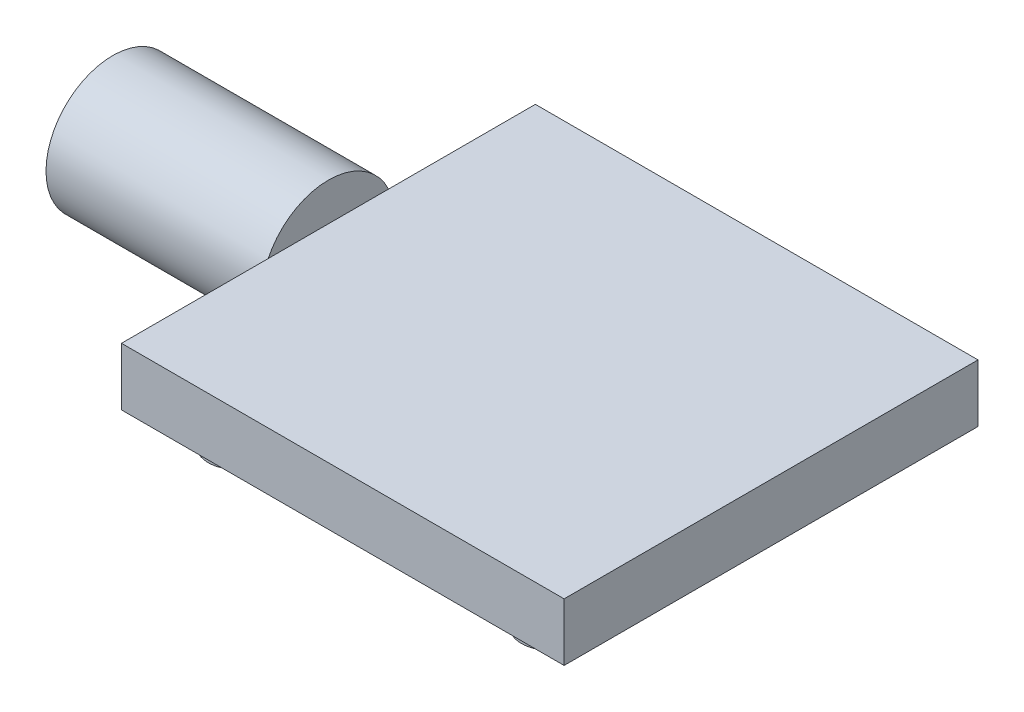
ISO-10303-21;
HEADER;
FILE_DESCRIPTION(('STEP AP214'),'2;1');
FILE_NAME('part.step','',(''),(''),'','','');
FILE_SCHEMA(('AUTOMOTIVE_DESIGN { 1 0 10303 214 1 1 1 1 }'));
ENDSEC;
DATA;
#1=APPLICATION_CONTEXT('core data for automotive mechanical design processes');
#2=APPLICATION_PROTOCOL_DEFINITION('international standard','automotive_design',2000,#1);
#3=PRODUCT_CONTEXT('',#1,'mechanical');
#4=PRODUCT('Part','Part','',(#3));
#5=PRODUCT_RELATED_PRODUCT_CATEGORY('part','',(#4));
#6=PRODUCT_DEFINITION_FORMATION('','',#4);
#7=PRODUCT_DEFINITION_CONTEXT('part definition',#1,'design');
#8=PRODUCT_DEFINITION('design','',#6,#7);
#9=PRODUCT_DEFINITION_SHAPE('','',#8);
#10=(LENGTH_UNIT() NAMED_UNIT(*) SI_UNIT(.MILLI.,.METRE.));
#11=(NAMED_UNIT(*) PLANE_ANGLE_UNIT() SI_UNIT($,.RADIAN.));
#12=(NAMED_UNIT(*) SI_UNIT($,.STERADIAN.) SOLID_ANGLE_UNIT());
#13=UNCERTAINTY_MEASURE_WITH_UNIT(LENGTH_MEASURE(1.E-05),#10,'distance_accuracy_value','');
#14=(GEOMETRIC_REPRESENTATION_CONTEXT(3) GLOBAL_UNCERTAINTY_ASSIGNED_CONTEXT((#13)) GLOBAL_UNIT_ASSIGNED_CONTEXT((#10,
#11,#12)) REPRESENTATION_CONTEXT('',''));
#15=CARTESIAN_POINT('',(0.,0.,0.));
#16=DIRECTION('',(0.,0.,1.));
#17=DIRECTION('',(1.,0.,0.));
#18=AXIS2_PLACEMENT_3D('',#15,#16,#17);
#19=CARTESIAN_POINT('',(-21.55,5.62,20.15));
#20=DIRECTION('',(1.,0.,0.));
#21=DIRECTION('',(0.,0.,-1.));
#22=AXIS2_PLACEMENT_3D('',#19,#20,#21);
#23=PLANE('',#22);
#24=CARTESIAN_POINT('',(-21.55,2.81,0.));
#25=DIRECTION('',(-1.,0.,0.));
#26=DIRECTION('',(0.,0.,1.));
#27=AXIS2_PLACEMENT_3D('',#24,#25,#26);
#28=CIRCLE('',#27,6.5);
#29=CARTESIAN_POINT('',(-21.55,5.62,-5.8612200095202));
#30=VERTEX_POINT('',#29);
#31=CARTESIAN_POINT('',(-21.55,0.,-5.8612200095202));
#32=VERTEX_POINT('',#31);
#33=EDGE_CURVE('E11',#30,#32,#28,.T.);
#34=ORIENTED_EDGE('',*,*,#33,.F.);
#35=DIRECTION('',(0.,0.,1.));
#36=VECTOR('',#35,1.);
#37=CARTESIAN_POINT('',(-21.55,5.62,20.15));
#38=LINE('',#37,#36);
#39=CARTESIAN_POINT('',(-21.55,5.62,-20.15));
#40=VERTEX_POINT('',#39);
#41=EDGE_CURVE('E103',#40,#30,#38,.T.);
#42=ORIENTED_EDGE('',*,*,#41,.F.);
#43=DIRECTION('',(0.,-1.,0.));
#44=VECTOR('',#43,1.);
#45=CARTESIAN_POINT('',(-21.55,5.62,-20.15));
#46=LINE('',#45,#44);
#47=CARTESIAN_POINT('',(-21.55,0.,-20.15));
#48=VERTEX_POINT('',#47);
#49=EDGE_CURVE('E171',#40,#48,#46,.T.);
#50=ORIENTED_EDGE('',*,*,#49,.T.);
#51=DIRECTION('',(0.,0.,1.));
#52=VECTOR('',#51,1.);
#53=CARTESIAN_POINT('',(-21.55,0.,20.15));
#54=LINE('',#53,#52);
#55=EDGE_CURVE('E164',#48,#32,#54,.T.);
#56=ORIENTED_EDGE('',*,*,#55,.T.);
#57=EDGE_LOOP('',(#34,#42,#50,#56));
#58=FACE_BOUND('',#57,.T.);
#59=ADVANCED_FACE('F43',(#58),#23,.F.);
#60=CARTESIAN_POINT('',(21.55,5.62,20.15));
#61=DIRECTION('',(-1.,0.,0.));
#62=DIRECTION('',(0.,0.,1.));
#63=AXIS2_PLACEMENT_3D('',#60,#61,#62);
#64=PLANE('',#63);
#65=DIRECTION('',(0.,0.,-1.));
#66=VECTOR('',#65,1.);
#67=CARTESIAN_POINT('',(21.55,0.,20.15));
#68=LINE('',#67,#66);
#69=CARTESIAN_POINT('',(21.55,0.,20.15));
#70=VERTEX_POINT('',#69);
#71=CARTESIAN_POINT('',(21.55,0.,-20.15));
#72=VERTEX_POINT('',#71);
#73=EDGE_CURVE('E158',#70,#72,#68,.T.);
#74=ORIENTED_EDGE('',*,*,#73,.T.);
#75=DIRECTION('',(0.,-1.,0.));
#76=VECTOR('',#75,1.);
#77=CARTESIAN_POINT('',(21.55,5.62,-20.15));
#78=LINE('',#77,#76);
#79=CARTESIAN_POINT('',(21.55,5.62,-20.15));
#80=VERTEX_POINT('',#79);
#81=EDGE_CURVE('E174',#80,#72,#78,.T.);
#82=ORIENTED_EDGE('',*,*,#81,.F.);
#83=DIRECTION('',(0.,0.,-1.));
#84=VECTOR('',#83,1.);
#85=CARTESIAN_POINT('',(21.55,5.62,20.15));
#86=LINE('',#85,#84);
#87=CARTESIAN_POINT('',(21.55,5.62,20.15));
#88=VERTEX_POINT('',#87);
#89=EDGE_CURVE('E151',#88,#80,#86,.T.);
#90=ORIENTED_EDGE('',*,*,#89,.F.);
#91=DIRECTION('',(0.,-1.,0.));
#92=VECTOR('',#91,1.);
#93=CARTESIAN_POINT('',(21.55,5.62,20.15));
#94=LINE('',#93,#92);
#95=EDGE_CURVE('E157',#88,#70,#94,.T.);
#96=ORIENTED_EDGE('',*,*,#95,.T.);
#97=EDGE_LOOP('',(#74,#82,#90,#96));
#98=FACE_BOUND('',#97,.T.);
#99=ADVANCED_FACE('F45',(#98),#64,.F.);
#100=CARTESIAN_POINT('',(-21.55,5.62,-20.15));
#101=DIRECTION('',(0.,0.,1.));
#102=DIRECTION('',(1.,0.,0.));
#103=AXIS2_PLACEMENT_3D('',#100,#101,#102);
#104=PLANE('',#103);
#105=DIRECTION('',(-1.,0.,0.));
#106=VECTOR('',#105,1.);
#107=CARTESIAN_POINT('',(-21.55,0.,-20.15));
#108=LINE('',#107,#106);
#109=EDGE_CURVE('E161',#72,#48,#108,.T.);
#110=ORIENTED_EDGE('',*,*,#109,.T.);
#111=ORIENTED_EDGE('',*,*,#49,.F.);
#112=DIRECTION('',(-1.,0.,0.));
#113=VECTOR('',#112,1.);
#114=CARTESIAN_POINT('',(-21.55,5.62,-20.15));
#115=LINE('',#114,#113);
#116=EDGE_CURVE('E112',#80,#40,#115,.T.);
#117=ORIENTED_EDGE('',*,*,#116,.F.);
#118=ORIENTED_EDGE('',*,*,#81,.T.);
#119=EDGE_LOOP('',(#110,#111,#117,#118));
#120=FACE_BOUND('',#119,.T.);
#121=ADVANCED_FACE('F229',(#120),#104,.F.);
#122=CARTESIAN_POINT('',(-21.55,0.,5.8612200095202));
#123=VERTEX_POINT('',#122);
#124=CARTESIAN_POINT('',(-21.55,5.62,5.8612200095202));
#125=VERTEX_POINT('',#124);
#126=EDGE_CURVE('E52',#123,#125,#28,.T.);
#127=ORIENTED_EDGE('',*,*,#126,.F.);
#128=CARTESIAN_POINT('',(-21.55,0.,20.15));
#129=VERTEX_POINT('',#128);
#130=EDGE_CURVE('E163',#123,#129,#54,.T.);
#131=ORIENTED_EDGE('',*,*,#130,.T.);
#132=DIRECTION('',(0.,-1.,0.));
#133=VECTOR('',#132,1.);
#134=CARTESIAN_POINT('',(-21.55,5.62,20.15));
#135=LINE('',#134,#133);
#136=CARTESIAN_POINT('',(-21.55,5.62,20.15));
#137=VERTEX_POINT('',#136);
#138=EDGE_CURVE('E110',#137,#129,#135,.T.);
#139=ORIENTED_EDGE('',*,*,#138,.F.);
#140=EDGE_CURVE('E101',#125,#137,#38,.T.);
#141=ORIENTED_EDGE('',*,*,#140,.F.);
#142=EDGE_LOOP('',(#127,#131,#139,#141));
#143=FACE_BOUND('',#142,.T.);
#144=ADVANCED_FACE('F108',(#143),#23,.F.);
#145=CARTESIAN_POINT('',(-21.55,5.62,20.15));
#146=DIRECTION('',(0.,0.,-1.));
#147=DIRECTION('',(-1.,0.,0.));
#148=AXIS2_PLACEMENT_3D('',#145,#146,#147);
#149=PLANE('',#148);
#150=DIRECTION('',(1.,0.,0.));
#151=VECTOR('',#150,1.);
#152=CARTESIAN_POINT('',(-21.55,0.,20.15));
#153=LINE('',#152,#151);
#154=EDGE_CURVE('E153',#129,#70,#153,.T.);
#155=ORIENTED_EDGE('',*,*,#154,.T.);
#156=ORIENTED_EDGE('',*,*,#95,.F.);
#157=DIRECTION('',(1.,0.,0.));
#158=VECTOR('',#157,1.);
#159=CARTESIAN_POINT('',(-21.55,5.62,20.15));
#160=LINE('',#159,#158);
#161=EDGE_CURVE('E155',#137,#88,#160,.T.);
#162=ORIENTED_EDGE('',*,*,#161,.F.);
#163=ORIENTED_EDGE('',*,*,#138,.T.);
#164=EDGE_LOOP('',(#155,#156,#162,#163));
#165=FACE_BOUND('',#164,.T.);
#166=ADVANCED_FACE('F232',(#165),#149,.F.);
#167=CARTESIAN_POINT('',(0.,5.62,0.));
#168=DIRECTION('',(0.,-1.,0.));
#169=DIRECTION('',(0.,0.,-1.));
#170=AXIS2_PLACEMENT_3D('',#167,#168,#169);
#171=PLANE('',#170);
#172=ORIENTED_EDGE('',*,*,#89,.T.);
#173=ORIENTED_EDGE('',*,*,#116,.T.);
#174=ORIENTED_EDGE('',*,*,#41,.T.);
#175=EDGE_CURVE('E98',#30,#125,#38,.T.);
#176=ORIENTED_EDGE('',*,*,#175,.T.);
#177=ORIENTED_EDGE('',*,*,#140,.T.);
#178=ORIENTED_EDGE('',*,*,#161,.T.);
#179=EDGE_LOOP('',(#172,#173,#174,#176,#177,#178));
#180=FACE_BOUND('',#179,.T.);
#181=ADVANCED_FACE('F100',(#180),#171,.F.);
#182=CARTESIAN_POINT('',(0.,0.,0.));
#183=DIRECTION('',(0.,-1.,0.));
#184=DIRECTION('',(0.,0.,-1.));
#185=AXIS2_PLACEMENT_3D('',#182,#183,#184);
#186=PLANE('',#185);
#187=CARTESIAN_POINT('',(-15.25,0.,15.25));
#188=DIRECTION('',(0.,-1.,0.));
#189=DIRECTION('',(0.,0.,-1.));
#190=AXIS2_PLACEMENT_3D('',#187,#188,#189);
#191=CIRCLE('',#190,2.75);
#192=CARTESIAN_POINT('',(-15.25,0.,12.5));
#193=VERTEX_POINT('',#192);
#194=EDGE_CURVE('E47',#193,#193,#191,.T.);
#195=ORIENTED_EDGE('',*,*,#194,.F.);
#196=EDGE_LOOP('',(#195));
#197=FACE_BOUND('',#196,.T.);
#198=CARTESIAN_POINT('',(15.25,0.,15.25));
#199=DIRECTION('',(0.,-1.,0.));
#200=DIRECTION('',(0.,0.,-1.));
#201=AXIS2_PLACEMENT_3D('',#198,#199,#200);
#202=CIRCLE('',#201,2.75);
#203=CARTESIAN_POINT('',(15.25,0.,12.5));
#204=VERTEX_POINT('',#203);
#205=EDGE_CURVE('E187',#204,#204,#202,.T.);
#206=ORIENTED_EDGE('',*,*,#205,.F.);
#207=EDGE_LOOP('',(#206));
#208=FACE_BOUND('',#207,.T.);
#209=CARTESIAN_POINT('',(15.25,0.,-15.25));
#210=DIRECTION('',(0.,-1.,0.));
#211=DIRECTION('',(0.,0.,-1.));
#212=AXIS2_PLACEMENT_3D('',#209,#210,#211);
#213=CIRCLE('',#212,2.75);
#214=CARTESIAN_POINT('',(15.25,0.,-18.));
#215=VERTEX_POINT('',#214);
#216=EDGE_CURVE('E182',#215,#215,#213,.T.);
#217=ORIENTED_EDGE('',*,*,#216,.F.);
#218=EDGE_LOOP('',(#217));
#219=FACE_BOUND('',#218,.T.);
#220=CARTESIAN_POINT('',(-15.25,0.,-15.25));
#221=DIRECTION('',(0.,-1.,0.));
#222=DIRECTION('',(0.,0.,-1.));
#223=AXIS2_PLACEMENT_3D('',#220,#221,#222);
#224=CIRCLE('',#223,2.75);
#225=CARTESIAN_POINT('',(-15.25,0.,-18.));
#226=VERTEX_POINT('',#225);
#227=EDGE_CURVE('E177',#226,#226,#224,.T.);
#228=ORIENTED_EDGE('',*,*,#227,.F.);
#229=EDGE_LOOP('',(#228));
#230=FACE_BOUND('',#229,.T.);
#231=ORIENTED_EDGE('',*,*,#73,.F.);
#232=ORIENTED_EDGE('',*,*,#154,.F.);
#233=ORIENTED_EDGE('',*,*,#130,.F.);
#234=EDGE_CURVE('E166',#32,#123,#54,.T.);
#235=ORIENTED_EDGE('',*,*,#234,.F.);
#236=ORIENTED_EDGE('',*,*,#55,.F.);
#237=ORIENTED_EDGE('',*,*,#109,.F.);
#238=EDGE_LOOP('',(#231,#232,#233,#235,#236,#237));
#239=FACE_BOUND('',#238,.T.);
#240=ADVANCED_FACE('F247',(#197,#208,#219,#230,#239),#186,.T.);
#241=CARTESIAN_POINT('',(-15.25,-2.38,-15.25));
#242=DIRECTION('',(0.,1.,0.));
#243=DIRECTION('',(0.,0.,1.));
#244=AXIS2_PLACEMENT_3D('',#241,#242,#243);
#245=CYLINDRICAL_SURFACE('',#244,2.75);
#246=ORIENTED_EDGE('',*,*,#227,.T.);
#247=EDGE_LOOP('',(#246));
#248=FACE_BOUND('',#247,.T.);
#249=CARTESIAN_POINT('',(-15.25,-2.38,-15.25));
#250=DIRECTION('',(0.,1.,0.));
#251=DIRECTION('',(0.,0.,1.));
#252=AXIS2_PLACEMENT_3D('',#249,#250,#251);
#253=CIRCLE('',#252,2.75);
#254=CARTESIAN_POINT('',(-15.25,-2.38,-12.5));
#255=VERTEX_POINT('',#254);
#256=EDGE_CURVE('E147',#255,#255,#253,.T.);
#257=ORIENTED_EDGE('',*,*,#256,.T.);
#258=EDGE_LOOP('',(#257));
#259=FACE_BOUND('',#258,.T.);
#260=ADVANCED_FACE('F383',(#248,#259),#245,.T.);
#261=CARTESIAN_POINT('',(-15.25,-2.38,-15.25));
#262=DIRECTION('',(0.,1.,0.));
#263=DIRECTION('',(0.,0.,1.));
#264=AXIS2_PLACEMENT_3D('',#261,#262,#263);
#265=PLANE('',#264);
#266=CARTESIAN_POINT('',(-15.25,-2.38,-15.25));
#267=DIRECTION('',(0.,1.,0.));
#268=DIRECTION('',(0.,0.,1.));
#269=AXIS2_PLACEMENT_3D('',#266,#267,#268);
#270=CIRCLE('',#269,1.75);
#271=CARTESIAN_POINT('',(-15.25,-2.38,-13.5));
#272=VERTEX_POINT('',#271);
#273=EDGE_CURVE('E144',#272,#272,#270,.T.);
#274=ORIENTED_EDGE('',*,*,#273,.T.);
#275=EDGE_LOOP('',(#274));
#276=FACE_BOUND('',#275,.T.);
#277=ORIENTED_EDGE('',*,*,#256,.F.);
#278=EDGE_LOOP('',(#277));
#279=FACE_BOUND('',#278,.T.);
#280=ADVANCED_FACE('F373',(#276,#279),#265,.F.);
#281=CARTESIAN_POINT('',(-15.25,-2.38,-15.25));
#282=DIRECTION('',(0.,1.,0.));
#283=DIRECTION('',(0.,0.,1.));
#284=AXIS2_PLACEMENT_3D('',#281,#282,#283);
#285=CYLINDRICAL_SURFACE('',#284,1.75);
#286=CARTESIAN_POINT('',(-15.25,0.,-15.25));
#287=DIRECTION('',(0.,-1.,0.));
#288=DIRECTION('',(0.,0.,-1.));
#289=AXIS2_PLACEMENT_3D('',#286,#287,#288);
#290=CIRCLE('',#289,1.75);
#291=CARTESIAN_POINT('',(-15.25,0.,-17.));
#292=VERTEX_POINT('',#291);
#293=EDGE_CURVE('E150',#292,#292,#290,.T.);
#294=ORIENTED_EDGE('',*,*,#293,.F.);
#295=EDGE_LOOP('',(#294));
#296=FACE_BOUND('',#295,.T.);
#297=ORIENTED_EDGE('',*,*,#273,.F.);
#298=EDGE_LOOP('',(#297));
#299=FACE_BOUND('',#298,.T.);
#300=ADVANCED_FACE('F368',(#296,#299),#285,.F.);
#301=ORIENTED_EDGE('',*,*,#293,.T.);
#302=EDGE_LOOP('',(#301));
#303=FACE_BOUND('',#302,.T.);
#304=ADVANCED_FACE('F361',(#303),#186,.T.);
#305=CARTESIAN_POINT('',(15.25,-2.38,-15.25));
#306=DIRECTION('',(0.,1.,0.));
#307=DIRECTION('',(0.,0.,1.));
#308=AXIS2_PLACEMENT_3D('',#305,#306,#307);
#309=CYLINDRICAL_SURFACE('',#308,2.75);
#310=ORIENTED_EDGE('',*,*,#216,.T.);
#311=EDGE_LOOP('',(#310));
#312=FACE_BOUND('',#311,.T.);
#313=CARTESIAN_POINT('',(15.25,-2.38,-15.25));
#314=DIRECTION('',(0.,1.,0.));
#315=DIRECTION('',(0.,0.,-1.));
#316=AXIS2_PLACEMENT_3D('',#313,#314,#315);
#317=CIRCLE('',#316,2.75);
#318=CARTESIAN_POINT('',(15.25,-2.38,-18.));
#319=VERTEX_POINT('',#318);
#320=EDGE_CURVE('E137',#319,#319,#317,.T.);
#321=ORIENTED_EDGE('',*,*,#320,.T.);
#322=EDGE_LOOP('',(#321));
#323=FACE_BOUND('',#322,.T.);
#324=ADVANCED_FACE('F351',(#312,#323),#309,.T.);
#325=CARTESIAN_POINT('',(15.25,-2.38,-15.25));
#326=DIRECTION('',(0.,-1.,0.));
#327=DIRECTION('',(0.,0.,-1.));
#328=AXIS2_PLACEMENT_3D('',#325,#326,#327);
#329=PLANE('',#328);
#330=CARTESIAN_POINT('',(15.25,-2.38,-15.25));
#331=DIRECTION('',(0.,1.,0.));
#332=DIRECTION('',(0.,0.,-1.));
#333=AXIS2_PLACEMENT_3D('',#330,#331,#332);
#334=CIRCLE('',#333,1.75);
#335=CARTESIAN_POINT('',(15.25,-2.38,-17.));
#336=VERTEX_POINT('',#335);
#337=EDGE_CURVE('E140',#336,#336,#334,.T.);
#338=ORIENTED_EDGE('',*,*,#337,.T.);
#339=EDGE_LOOP('',(#338));
#340=FACE_BOUND('',#339,.T.);
#341=ORIENTED_EDGE('',*,*,#320,.F.);
#342=EDGE_LOOP('',(#341));
#343=FACE_BOUND('',#342,.T.);
#344=ADVANCED_FACE('F341',(#340,#343),#329,.T.);
#345=CARTESIAN_POINT('',(15.25,-2.38,-15.25));
#346=DIRECTION('',(0.,1.,0.));
#347=DIRECTION('',(0.,0.,1.));
#348=AXIS2_PLACEMENT_3D('',#345,#346,#347);
#349=CYLINDRICAL_SURFACE('',#348,1.75);
#350=CARTESIAN_POINT('',(15.25,0.,-15.25));
#351=DIRECTION('',(0.,-1.,0.));
#352=DIRECTION('',(0.,0.,-1.));
#353=AXIS2_PLACEMENT_3D('',#350,#351,#352);
#354=CIRCLE('',#353,1.75);
#355=CARTESIAN_POINT('',(15.25,0.,-17.));
#356=VERTEX_POINT('',#355);
#357=EDGE_CURVE('E143',#356,#356,#354,.T.);
#358=ORIENTED_EDGE('',*,*,#357,.F.);
#359=EDGE_LOOP('',(#358));
#360=FACE_BOUND('',#359,.T.);
#361=ORIENTED_EDGE('',*,*,#337,.F.);
#362=EDGE_LOOP('',(#361));
#363=FACE_BOUND('',#362,.T.);
#364=ADVANCED_FACE('F336',(#360,#363),#349,.F.);
#365=ORIENTED_EDGE('',*,*,#357,.T.);
#366=EDGE_LOOP('',(#365));
#367=FACE_BOUND('',#366,.T.);
#368=ADVANCED_FACE('F219',(#367),#186,.T.);
#369=CARTESIAN_POINT('',(15.25,-2.38,15.25));
#370=DIRECTION('',(0.,1.,0.));
#371=DIRECTION('',(0.,0.,1.));
#372=AXIS2_PLACEMENT_3D('',#369,#370,#371);
#373=CYLINDRICAL_SURFACE('',#372,2.75);
#374=ORIENTED_EDGE('',*,*,#205,.T.);
#375=EDGE_LOOP('',(#374));
#376=FACE_BOUND('',#375,.T.);
#377=CARTESIAN_POINT('',(15.25,-2.38,15.25));
#378=DIRECTION('',(0.,1.,0.));
#379=DIRECTION('',(0.,0.,1.));
#380=AXIS2_PLACEMENT_3D('',#377,#378,#379);
#381=CIRCLE('',#380,2.75);
#382=CARTESIAN_POINT('',(15.25,-2.38,18.));
#383=VERTEX_POINT('',#382);
#384=EDGE_CURVE('E130',#383,#383,#381,.T.);
#385=ORIENTED_EDGE('',*,*,#384,.T.);
#386=EDGE_LOOP('',(#385));
#387=FACE_BOUND('',#386,.T.);
#388=ADVANCED_FACE('F320',(#376,#387),#373,.T.);
#389=CARTESIAN_POINT('',(15.25,-2.38,15.25));
#390=DIRECTION('',(0.,1.,0.));
#391=DIRECTION('',(0.,0.,1.));
#392=AXIS2_PLACEMENT_3D('',#389,#390,#391);
#393=PLANE('',#392);
#394=CARTESIAN_POINT('',(15.25,-2.38,15.25));
#395=DIRECTION('',(0.,1.,0.));
#396=DIRECTION('',(0.,0.,1.));
#397=AXIS2_PLACEMENT_3D('',#394,#395,#396);
#398=CIRCLE('',#397,1.75);
#399=CARTESIAN_POINT('',(15.25,-2.38,17.));
#400=VERTEX_POINT('',#399);
#401=EDGE_CURVE('E133',#400,#400,#398,.T.);
#402=ORIENTED_EDGE('',*,*,#401,.T.);
#403=EDGE_LOOP('',(#402));
#404=FACE_BOUND('',#403,.T.);
#405=ORIENTED_EDGE('',*,*,#384,.F.);
#406=EDGE_LOOP('',(#405));
#407=FACE_BOUND('',#406,.T.);
#408=ADVANCED_FACE('F310',(#404,#407),#393,.F.);
#409=CARTESIAN_POINT('',(15.25,-2.38,15.25));
#410=DIRECTION('',(0.,1.,0.));
#411=DIRECTION('',(0.,0.,1.));
#412=AXIS2_PLACEMENT_3D('',#409,#410,#411);
#413=CYLINDRICAL_SURFACE('',#412,1.75);
#414=CARTESIAN_POINT('',(15.25,0.,15.25));
#415=DIRECTION('',(0.,-1.,0.));
#416=DIRECTION('',(0.,0.,-1.));
#417=AXIS2_PLACEMENT_3D('',#414,#415,#416);
#418=CIRCLE('',#417,1.75);
#419=CARTESIAN_POINT('',(15.25,0.,13.5));
#420=VERTEX_POINT('',#419);
#421=EDGE_CURVE('E136',#420,#420,#418,.T.);
#422=ORIENTED_EDGE('',*,*,#421,.F.);
#423=EDGE_LOOP('',(#422));
#424=FACE_BOUND('',#423,.T.);
#425=ORIENTED_EDGE('',*,*,#401,.F.);
#426=EDGE_LOOP('',(#425));
#427=FACE_BOUND('',#426,.T.);
#428=ADVANCED_FACE('F216',(#424,#427),#413,.F.);
#429=ORIENTED_EDGE('',*,*,#421,.T.);
#430=EDGE_LOOP('',(#429));
#431=FACE_BOUND('',#430,.T.);
#432=ADVANCED_FACE('F210',(#431),#186,.T.);
#433=CARTESIAN_POINT('',(-15.25,-2.38,15.25));
#434=DIRECTION('',(0.,1.,0.));
#435=DIRECTION('',(0.,0.,1.));
#436=AXIS2_PLACEMENT_3D('',#433,#434,#435);
#437=CYLINDRICAL_SURFACE('',#436,2.75);
#438=ORIENTED_EDGE('',*,*,#194,.T.);
#439=EDGE_LOOP('',(#438));
#440=FACE_BOUND('',#439,.T.);
#441=CARTESIAN_POINT('',(-15.25,-2.38,15.25));
#442=DIRECTION('',(0.,1.,0.));
#443=DIRECTION('',(0.,0.,-1.));
#444=AXIS2_PLACEMENT_3D('',#441,#442,#443);
#445=CIRCLE('',#444,2.75);
#446=CARTESIAN_POINT('',(-15.25,-2.38,12.5));
#447=VERTEX_POINT('',#446);
#448=EDGE_CURVE('E121',#447,#447,#445,.T.);
#449=ORIENTED_EDGE('',*,*,#448,.T.);
#450=EDGE_LOOP('',(#449));
#451=FACE_BOUND('',#450,.T.);
#452=ADVANCED_FACE('F205',(#440,#451),#437,.T.);
#453=CARTESIAN_POINT('',(-15.25,-2.38,15.25));
#454=DIRECTION('',(0.,-1.,0.));
#455=DIRECTION('',(0.,0.,-1.));
#456=AXIS2_PLACEMENT_3D('',#453,#454,#455);
#457=PLANE('',#456);
#458=CARTESIAN_POINT('',(-15.25,-2.38,15.25));
#459=DIRECTION('',(0.,1.,0.));
#460=DIRECTION('',(0.,0.,-1.));
#461=AXIS2_PLACEMENT_3D('',#458,#459,#460);
#462=CIRCLE('',#461,1.75);
#463=CARTESIAN_POINT('',(-15.25,-2.38,13.5));
#464=VERTEX_POINT('',#463);
#465=EDGE_CURVE('E126',#464,#464,#462,.T.);
#466=ORIENTED_EDGE('',*,*,#465,.T.);
#467=EDGE_LOOP('',(#466));
#468=FACE_BOUND('',#467,.T.);
#469=ORIENTED_EDGE('',*,*,#448,.F.);
#470=EDGE_LOOP('',(#469));
#471=FACE_BOUND('',#470,.T.);
#472=ADVANCED_FACE('F199',(#468,#471),#457,.T.);
#473=CARTESIAN_POINT('',(-15.25,-2.38,15.25));
#474=DIRECTION('',(0.,1.,0.));
#475=DIRECTION('',(0.,0.,1.));
#476=AXIS2_PLACEMENT_3D('',#473,#474,#475);
#477=CYLINDRICAL_SURFACE('',#476,1.75);
#478=CARTESIAN_POINT('',(-15.25,0.,15.25));
#479=DIRECTION('',(0.,-1.,0.));
#480=DIRECTION('',(0.,0.,-1.));
#481=AXIS2_PLACEMENT_3D('',#478,#479,#480);
#482=CIRCLE('',#481,1.75);
#483=CARTESIAN_POINT('',(-15.25,0.,13.5));
#484=VERTEX_POINT('',#483);
#485=EDGE_CURVE('E129',#484,#484,#482,.T.);
#486=ORIENTED_EDGE('',*,*,#485,.F.);
#487=EDGE_LOOP('',(#486));
#488=FACE_BOUND('',#487,.T.);
#489=ORIENTED_EDGE('',*,*,#465,.F.);
#490=EDGE_LOOP('',(#489));
#491=FACE_BOUND('',#490,.T.);
#492=ADVANCED_FACE('F196',(#488,#491),#477,.F.);
#493=ORIENTED_EDGE('',*,*,#485,.T.);
#494=EDGE_LOOP('',(#493));
#495=FACE_BOUND('',#494,.T.);
#496=ADVANCED_FACE('F194',(#495),#186,.T.);
#497=CARTESIAN_POINT('',(-21.55,2.81,0.));
#498=DIRECTION('',(-1.,0.,0.));
#499=DIRECTION('',(0.,0.,1.));
#500=AXIS2_PLACEMENT_3D('',#497,#498,#499);
#501=PLANE('',#500);
#502=EDGE_CURVE('E54',#32,#123,#28,.T.);
#503=ORIENTED_EDGE('',*,*,#502,.F.);
#504=ORIENTED_EDGE('',*,*,#234,.T.);
#505=EDGE_LOOP('',(#503,#504));
#506=FACE_BOUND('',#505,.T.);
#507=ADVANCED_FACE('F253',(#506),#501,.F.);
#508=CARTESIAN_POINT('',(-42.55,2.81,0.));
#509=DIRECTION('',(1.,0.,0.));
#510=DIRECTION('',(0.,0.,-1.));
#511=AXIS2_PLACEMENT_3D('',#508,#509,#510);
#512=CYLINDRICAL_SURFACE('',#511,6.5);
#513=CARTESIAN_POINT('',(-42.55,2.81,0.));
#514=DIRECTION('',(-1.,0.,0.));
#515=DIRECTION('',(0.,0.,1.));
#516=AXIS2_PLACEMENT_3D('',#513,#514,#515);
#517=CIRCLE('',#516,6.5);
#518=CARTESIAN_POINT('',(-42.55,2.81,6.5));
#519=VERTEX_POINT('',#518);
#520=EDGE_CURVE('E119',#519,#519,#517,.T.);
#521=ORIENTED_EDGE('',*,*,#520,.F.);
#522=EDGE_LOOP('',(#521));
#523=FACE_BOUND('',#522,.T.);
#524=EDGE_CURVE('E116',#125,#30,#28,.T.);
#525=ORIENTED_EDGE('',*,*,#524,.T.);
#526=ORIENTED_EDGE('',*,*,#33,.T.);
#527=ORIENTED_EDGE('',*,*,#502,.T.);
#528=ORIENTED_EDGE('',*,*,#126,.T.);
#529=EDGE_LOOP('',(#525,#526,#527,#528));
#530=FACE_BOUND('',#529,.T.);
#531=ADVANCED_FACE('F115',(#523,#530),#512,.T.);
#532=CARTESIAN_POINT('',(-42.55,2.81,0.));
#533=DIRECTION('',(-1.,0.,0.));
#534=DIRECTION('',(0.,0.,1.));
#535=AXIS2_PLACEMENT_3D('',#532,#533,#534);
#536=PLANE('',#535);
#537=ORIENTED_EDGE('',*,*,#520,.T.);
#538=EDGE_LOOP('',(#537));
#539=FACE_BOUND('',#538,.T.);
#540=ADVANCED_FACE('F260',(#539),#536,.T.);
#541=ORIENTED_EDGE('',*,*,#175,.F.);
#542=ORIENTED_EDGE('',*,*,#524,.F.);
#543=EDGE_LOOP('',(#541,#542));
#544=FACE_BOUND('',#543,.T.);
#545=ADVANCED_FACE('F118',(#544),#501,.F.);
#546=CLOSED_SHELL('',(#59,#99,#121,#144,#166,#181,#240,#260,#280,#300,#304,#324,#344,#364,#368,
#388,#408,#428,#432,#452,#472,#492,#496,#507,#531,#540,#545));
#547=MANIFOLD_SOLID_BREP('B2',#546);
#548=ADVANCED_BREP_SHAPE_REPRESENTATION('',(#18,#547),#14);
#549=SHAPE_DEFINITION_REPRESENTATION(#9,#548);
ENDSEC;
END-ISO-10303-21;
